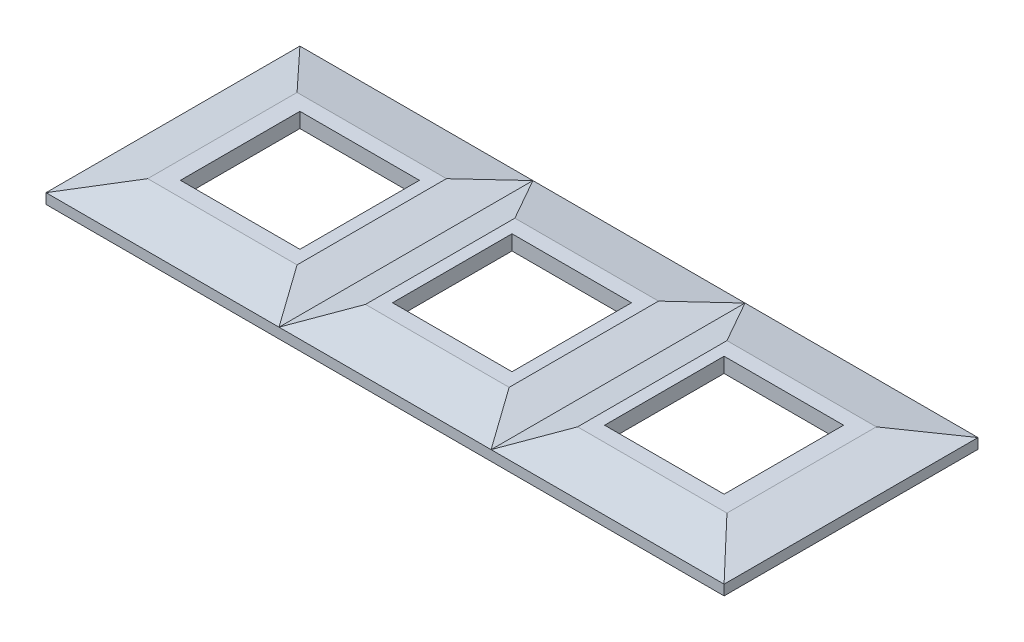
ISO-10303-21;
HEADER;
FILE_DESCRIPTION(('STEP AP214'),'2;1');
FILE_NAME('part.step','',(''),(''),'','','');
FILE_SCHEMA(('AUTOMOTIVE_DESIGN { 1 0 10303 214 1 1 1 1 }'));
ENDSEC;
DATA;
#1=APPLICATION_CONTEXT('core data for automotive mechanical design processes');
#2=APPLICATION_PROTOCOL_DEFINITION('international standard','automotive_design',2000,#1);
#3=PRODUCT_CONTEXT('',#1,'mechanical');
#4=PRODUCT('Part','Part','',(#3));
#5=PRODUCT_RELATED_PRODUCT_CATEGORY('part','',(#4));
#6=PRODUCT_DEFINITION_FORMATION('','',#4);
#7=PRODUCT_DEFINITION_CONTEXT('part definition',#1,'design');
#8=PRODUCT_DEFINITION('design','',#6,#7);
#9=PRODUCT_DEFINITION_SHAPE('','',#8);
#10=(LENGTH_UNIT() NAMED_UNIT(*) SI_UNIT(.MILLI.,.METRE.));
#11=(NAMED_UNIT(*) PLANE_ANGLE_UNIT() SI_UNIT($,.RADIAN.));
#12=(NAMED_UNIT(*) SI_UNIT($,.STERADIAN.) SOLID_ANGLE_UNIT());
#13=UNCERTAINTY_MEASURE_WITH_UNIT(LENGTH_MEASURE(1.E-05),#10,'distance_accuracy_value','');
#14=(GEOMETRIC_REPRESENTATION_CONTEXT(3) GLOBAL_UNCERTAINTY_ASSIGNED_CONTEXT((#13)) GLOBAL_UNIT_ASSIGNED_CONTEXT((#10,
#11,#12)) REPRESENTATION_CONTEXT('',''));
#15=CARTESIAN_POINT('',(0.,0.,0.));
#16=DIRECTION('',(0.,0.,1.));
#17=DIRECTION('',(1.,0.,0.));
#18=AXIS2_PLACEMENT_3D('',#15,#16,#17);
#19=CARTESIAN_POINT('',(20.,7.00000000000003,20.));
#20=DIRECTION('',(1.,0.,0.));
#21=DIRECTION('',(0.,0.,-1.));
#22=AXIS2_PLACEMENT_3D('',#19,#20,#21);
#23=PLANE('',#22);
#24=DIRECTION('',(0.,0.,-1.));
#25=VECTOR('',#24,1.);
#26=CARTESIAN_POINT('',(20.,2.,20.));
#27=LINE('',#26,#25);
#28=CARTESIAN_POINT('',(20.,2.,20.));
#29=VERTEX_POINT('',#28);
#30=CARTESIAN_POINT('',(20.,2.,-20.));
#31=VERTEX_POINT('',#30);
#32=EDGE_CURVE('E312',#29,#31,#27,.T.);
#33=ORIENTED_EDGE('',*,*,#32,.F.);
#34=DIRECTION('',(0.,-1.,0.));
#35=VECTOR('',#34,1.);
#36=CARTESIAN_POINT('',(20.,7.00000000000003,20.));
#37=LINE('',#36,#35);
#38=CARTESIAN_POINT('',(20.,7.00000000000003,20.));
#39=VERTEX_POINT('',#38);
#40=EDGE_CURVE('E406',#39,#29,#37,.T.);
#41=ORIENTED_EDGE('',*,*,#40,.F.);
#42=DIRECTION('',(0.,0.,1.));
#43=VECTOR('',#42,1.);
#44=CARTESIAN_POINT('',(20.,7.00000000000003,20.));
#45=LINE('',#44,#43);
#46=CARTESIAN_POINT('',(20.,7.00000000000003,-20.));
#47=VERTEX_POINT('',#46);
#48=EDGE_CURVE('E364',#47,#39,#45,.T.);
#49=ORIENTED_EDGE('',*,*,#48,.F.);
#50=DIRECTION('',(0.,-1.,0.));
#51=VECTOR('',#50,1.);
#52=CARTESIAN_POINT('',(20.,7.00000000000003,-20.));
#53=LINE('',#52,#51);
#54=EDGE_CURVE('E407',#47,#31,#53,.T.);
#55=ORIENTED_EDGE('',*,*,#54,.T.);
#56=EDGE_LOOP('',(#33,#41,#49,#55));
#57=FACE_BOUND('',#56,.T.);
#58=ADVANCED_FACE('F40',(#57),#23,.F.);
#59=CARTESIAN_POINT('',(-20.,7.00000000000003,-20.));
#60=DIRECTION('',(0.,0.,-1.));
#61=DIRECTION('',(-1.,0.,0.));
#62=AXIS2_PLACEMENT_3D('',#59,#60,#61);
#63=PLANE('',#62);
#64=DIRECTION('',(-1.,0.,0.));
#65=VECTOR('',#64,1.);
#66=CARTESIAN_POINT('',(-20.,2.,-20.));
#67=LINE('',#66,#65);
#68=CARTESIAN_POINT('',(-20.,2.,-20.));
#69=VERTEX_POINT('',#68);
#70=EDGE_CURVE('E310',#31,#69,#67,.T.);
#71=ORIENTED_EDGE('',*,*,#70,.F.);
#72=ORIENTED_EDGE('',*,*,#54,.F.);
#73=DIRECTION('',(1.,0.,0.));
#74=VECTOR('',#73,1.);
#75=CARTESIAN_POINT('',(-20.,7.00000000000003,-20.));
#76=LINE('',#75,#74);
#77=CARTESIAN_POINT('',(-20.,7.00000000000003,-20.));
#78=VERTEX_POINT('',#77);
#79=EDGE_CURVE('E403',#78,#47,#76,.T.);
#80=ORIENTED_EDGE('',*,*,#79,.F.);
#81=DIRECTION('',(0.,-1.,0.));
#82=VECTOR('',#81,1.);
#83=CARTESIAN_POINT('',(-20.,7.00000000000003,-20.));
#84=LINE('',#83,#82);
#85=EDGE_CURVE('E411',#78,#69,#84,.T.);
#86=ORIENTED_EDGE('',*,*,#85,.T.);
#87=EDGE_LOOP('',(#71,#72,#80,#86));
#88=FACE_BOUND('',#87,.T.);
#89=ADVANCED_FACE('F601',(#88),#63,.F.);
#90=CARTESIAN_POINT('',(-20.,7.00000000000003,20.));
#91=DIRECTION('',(-1.,0.,0.));
#92=DIRECTION('',(0.,0.,1.));
#93=AXIS2_PLACEMENT_3D('',#90,#91,#92);
#94=PLANE('',#93);
#95=DIRECTION('',(0.,0.,1.));
#96=VECTOR('',#95,1.);
#97=CARTESIAN_POINT('',(-20.,2.,20.));
#98=LINE('',#97,#96);
#99=CARTESIAN_POINT('',(-20.,2.,20.));
#100=VERTEX_POINT('',#99);
#101=EDGE_CURVE('E55',#69,#100,#98,.T.);
#102=ORIENTED_EDGE('',*,*,#101,.F.);
#103=ORIENTED_EDGE('',*,*,#85,.F.);
#104=DIRECTION('',(0.,0.,-1.));
#105=VECTOR('',#104,1.);
#106=CARTESIAN_POINT('',(-20.,7.00000000000003,20.));
#107=LINE('',#106,#105);
#108=CARTESIAN_POINT('',(-20.,7.,20.));
#109=VERTEX_POINT('',#108);
#110=EDGE_CURVE('E400',#109,#78,#107,.T.);
#111=ORIENTED_EDGE('',*,*,#110,.F.);
#112=DIRECTION('',(0.,-1.,0.));
#113=VECTOR('',#112,1.);
#114=CARTESIAN_POINT('',(-20.,7.00000000000003,20.));
#115=LINE('',#114,#113);
#116=EDGE_CURVE('E414',#109,#100,#115,.T.);
#117=ORIENTED_EDGE('',*,*,#116,.T.);
#118=EDGE_LOOP('',(#102,#103,#111,#117));
#119=FACE_BOUND('',#118,.T.);
#120=ADVANCED_FACE('F607',(#119),#94,.F.);
#121=CARTESIAN_POINT('',(-20.,7.00000000000003,20.));
#122=DIRECTION('',(0.,0.,1.));
#123=DIRECTION('',(1.,0.,0.));
#124=AXIS2_PLACEMENT_3D('',#121,#122,#123);
#125=PLANE('',#124);
#126=DIRECTION('',(1.,0.,0.));
#127=VECTOR('',#126,1.);
#128=CARTESIAN_POINT('',(-20.,2.,20.));
#129=LINE('',#128,#127);
#130=EDGE_CURVE('E307',#100,#29,#129,.T.);
#131=ORIENTED_EDGE('',*,*,#130,.F.);
#132=ORIENTED_EDGE('',*,*,#116,.F.);
#133=DIRECTION('',(-1.,0.,0.));
#134=VECTOR('',#133,1.);
#135=CARTESIAN_POINT('',(-20.,7.00000000000003,20.));
#136=LINE('',#135,#134);
#137=EDGE_CURVE('E397',#39,#109,#136,.T.);
#138=ORIENTED_EDGE('',*,*,#137,.F.);
#139=ORIENTED_EDGE('',*,*,#40,.T.);
#140=EDGE_LOOP('',(#131,#132,#138,#139));
#141=FACE_BOUND('',#140,.T.);
#142=ADVANCED_FACE('F612',(#141),#125,.F.);
#143=CARTESIAN_POINT('',(91.,7.00000000000003,20.));
#144=DIRECTION('',(1.,0.,0.));
#145=DIRECTION('',(0.,0.,-1.));
#146=AXIS2_PLACEMENT_3D('',#143,#144,#145);
#147=PLANE('',#146);
#148=DIRECTION('',(0.,0.,-1.));
#149=VECTOR('',#148,1.);
#150=CARTESIAN_POINT('',(91.,2.,20.));
#151=LINE('',#150,#149);
#152=CARTESIAN_POINT('',(91.,2.,20.));
#153=VERTEX_POINT('',#152);
#154=CARTESIAN_POINT('',(91.,2.,-20.));
#155=VERTEX_POINT('',#154);
#156=EDGE_CURVE('E305',#153,#155,#151,.T.);
#157=ORIENTED_EDGE('',*,*,#156,.F.);
#158=DIRECTION('',(0.,-1.,0.));
#159=VECTOR('',#158,1.);
#160=CARTESIAN_POINT('',(91.,7.00000000000003,20.));
#161=LINE('',#160,#159);
#162=CARTESIAN_POINT('',(91.,7.00000000000003,20.));
#163=VERTEX_POINT('',#162);
#164=EDGE_CURVE('E360',#163,#153,#161,.T.);
#165=ORIENTED_EDGE('',*,*,#164,.F.);
#166=DIRECTION('',(0.,0.,1.));
#167=VECTOR('',#166,1.);
#168=CARTESIAN_POINT('',(91.,7.00000000000003,20.));
#169=LINE('',#168,#167);
#170=CARTESIAN_POINT('',(91.,7.00000000000003,-20.));
#171=VERTEX_POINT('',#170);
#172=EDGE_CURVE('E347',#171,#163,#169,.T.);
#173=ORIENTED_EDGE('',*,*,#172,.F.);
#174=DIRECTION('',(0.,-1.,0.));
#175=VECTOR('',#174,1.);
#176=CARTESIAN_POINT('',(91.,7.00000000000003,-20.));
#177=LINE('',#176,#175);
#178=EDGE_CURVE('E361',#171,#155,#177,.T.);
#179=ORIENTED_EDGE('',*,*,#178,.T.);
#180=EDGE_LOOP('',(#157,#165,#173,#179));
#181=FACE_BOUND('',#180,.T.);
#182=ADVANCED_FACE('F835',(#181),#147,.F.);
#183=CARTESIAN_POINT('',(51.,7.00000000000003,-20.));
#184=DIRECTION('',(0.,0.,-1.));
#185=DIRECTION('',(-1.,0.,0.));
#186=AXIS2_PLACEMENT_3D('',#183,#184,#185);
#187=PLANE('',#186);
#188=DIRECTION('',(-1.,0.,0.));
#189=VECTOR('',#188,1.);
#190=CARTESIAN_POINT('',(51.,2.,-20.));
#191=LINE('',#190,#189);
#192=CARTESIAN_POINT('',(51.,2.,-20.));
#193=VERTEX_POINT('',#192);
#194=EDGE_CURVE('E303',#155,#193,#191,.T.);
#195=ORIENTED_EDGE('',*,*,#194,.F.);
#196=ORIENTED_EDGE('',*,*,#178,.F.);
#197=DIRECTION('',(1.,0.,0.));
#198=VECTOR('',#197,1.);
#199=CARTESIAN_POINT('',(51.,7.00000000000003,-20.));
#200=LINE('',#199,#198);
#201=CARTESIAN_POINT('',(51.,7.00000000000003,-20.));
#202=VERTEX_POINT('',#201);
#203=EDGE_CURVE('E357',#202,#171,#200,.T.);
#204=ORIENTED_EDGE('',*,*,#203,.F.);
#205=DIRECTION('',(0.,-1.,0.));
#206=VECTOR('',#205,1.);
#207=CARTESIAN_POINT('',(51.,7.00000000000003,-20.));
#208=LINE('',#207,#206);
#209=EDGE_CURVE('E365',#202,#193,#208,.T.);
#210=ORIENTED_EDGE('',*,*,#209,.T.);
#211=EDGE_LOOP('',(#195,#196,#204,#210));
#212=FACE_BOUND('',#211,.T.);
#213=ADVANCED_FACE('F844',(#212),#187,.F.);
#214=CARTESIAN_POINT('',(51.,7.00000000000003,20.));
#215=DIRECTION('',(-1.,0.,0.));
#216=DIRECTION('',(0.,0.,1.));
#217=AXIS2_PLACEMENT_3D('',#214,#215,#216);
#218=PLANE('',#217);
#219=DIRECTION('',(0.,0.,1.));
#220=VECTOR('',#219,1.);
#221=CARTESIAN_POINT('',(51.,2.,20.));
#222=LINE('',#221,#220);
#223=CARTESIAN_POINT('',(51.,2.,20.));
#224=VERTEX_POINT('',#223);
#225=EDGE_CURVE('E63',#193,#224,#222,.T.);
#226=ORIENTED_EDGE('',*,*,#225,.F.);
#227=ORIENTED_EDGE('',*,*,#209,.F.);
#228=DIRECTION('',(0.,0.,-1.));
#229=VECTOR('',#228,1.);
#230=CARTESIAN_POINT('',(51.,7.00000000000003,20.));
#231=LINE('',#230,#229);
#232=CARTESIAN_POINT('',(51.,7.,20.));
#233=VERTEX_POINT('',#232);
#234=EDGE_CURVE('E354',#233,#202,#231,.T.);
#235=ORIENTED_EDGE('',*,*,#234,.F.);
#236=DIRECTION('',(0.,-1.,0.));
#237=VECTOR('',#236,1.);
#238=CARTESIAN_POINT('',(51.,7.00000000000003,20.));
#239=LINE('',#238,#237);
#240=EDGE_CURVE('E368',#233,#224,#239,.T.);
#241=ORIENTED_EDGE('',*,*,#240,.T.);
#242=EDGE_LOOP('',(#226,#227,#235,#241));
#243=FACE_BOUND('',#242,.T.);
#244=ADVANCED_FACE('F854',(#243),#218,.F.);
#245=CARTESIAN_POINT('',(51.,7.00000000000003,20.));
#246=DIRECTION('',(0.,0.,1.));
#247=DIRECTION('',(1.,0.,0.));
#248=AXIS2_PLACEMENT_3D('',#245,#246,#247);
#249=PLANE('',#248);
#250=DIRECTION('',(1.,0.,0.));
#251=VECTOR('',#250,1.);
#252=CARTESIAN_POINT('',(51.,2.,20.));
#253=LINE('',#252,#251);
#254=EDGE_CURVE('E300',#224,#153,#253,.T.);
#255=ORIENTED_EDGE('',*,*,#254,.F.);
#256=ORIENTED_EDGE('',*,*,#240,.F.);
#257=DIRECTION('',(-1.,0.,0.));
#258=VECTOR('',#257,1.);
#259=CARTESIAN_POINT('',(51.,7.00000000000003,20.));
#260=LINE('',#259,#258);
#261=EDGE_CURVE('E350',#163,#233,#260,.T.);
#262=ORIENTED_EDGE('',*,*,#261,.F.);
#263=ORIENTED_EDGE('',*,*,#164,.T.);
#264=EDGE_LOOP('',(#255,#256,#262,#263));
#265=FACE_BOUND('',#264,.T.);
#266=ADVANCED_FACE('F864',(#265),#249,.F.);
#267=CARTESIAN_POINT('',(-51.,7.00000000000003,19.9999999999995));
#268=DIRECTION('',(1.,0.,0.));
#269=DIRECTION('',(0.,0.,-1.));
#270=AXIS2_PLACEMENT_3D('',#267,#268,#269);
#271=PLANE('',#270);
#272=DIRECTION('',(0.,0.,-1.));
#273=VECTOR('',#272,1.);
#274=CARTESIAN_POINT('',(-51.,2.,19.9999999999995));
#275=LINE('',#274,#273);
#276=CARTESIAN_POINT('',(-51.,2.,19.9999999999995));
#277=VERTEX_POINT('',#276);
#278=CARTESIAN_POINT('',(-51.,2.,-20.0000000000005));
#279=VERTEX_POINT('',#278);
#280=EDGE_CURVE('E298',#277,#279,#275,.T.);
#281=ORIENTED_EDGE('',*,*,#280,.F.);
#282=DIRECTION('',(0.,-1.,0.));
#283=VECTOR('',#282,1.);
#284=CARTESIAN_POINT('',(-51.,7.00000000000003,19.9999999999995));
#285=LINE('',#284,#283);
#286=CARTESIAN_POINT('',(-51.,7.00000000000003,19.9999999999995));
#287=VERTEX_POINT('',#286);
#288=EDGE_CURVE('E384',#287,#277,#285,.T.);
#289=ORIENTED_EDGE('',*,*,#288,.F.);
#290=DIRECTION('',(0.,0.,1.));
#291=VECTOR('',#290,1.);
#292=CARTESIAN_POINT('',(-51.,7.00000000000003,19.9999999999995));
#293=LINE('',#292,#291);
#294=CARTESIAN_POINT('',(-51.,7.00000000000003,-20.0000000000005));
#295=VERTEX_POINT('',#294);
#296=EDGE_CURVE('E340',#295,#287,#293,.T.);
#297=ORIENTED_EDGE('',*,*,#296,.F.);
#298=DIRECTION('',(0.,-1.,0.));
#299=VECTOR('',#298,1.);
#300=CARTESIAN_POINT('',(-51.,7.00000000000003,-20.0000000000005));
#301=LINE('',#300,#299);
#302=EDGE_CURVE('E351',#295,#279,#301,.T.);
#303=ORIENTED_EDGE('',*,*,#302,.T.);
#304=EDGE_LOOP('',(#281,#289,#297,#303));
#305=FACE_BOUND('',#304,.T.);
#306=ADVANCED_FACE('F874',(#305),#271,.F.);
#307=CARTESIAN_POINT('',(-91.,7.00000000000003,-20.0000000000005));
#308=DIRECTION('',(0.,0.,-1.));
#309=DIRECTION('',(-1.,0.,0.));
#310=AXIS2_PLACEMENT_3D('',#307,#308,#309);
#311=PLANE('',#310);
#312=DIRECTION('',(-1.,0.,0.));
#313=VECTOR('',#312,1.);
#314=CARTESIAN_POINT('',(-91.,2.,-20.0000000000005));
#315=LINE('',#314,#313);
#316=CARTESIAN_POINT('',(-91.,2.,-20.0000000000005));
#317=VERTEX_POINT('',#316);
#318=EDGE_CURVE('E296',#279,#317,#315,.T.);
#319=ORIENTED_EDGE('',*,*,#318,.F.);
#320=ORIENTED_EDGE('',*,*,#302,.F.);
#321=DIRECTION('',(1.,0.,0.));
#322=VECTOR('',#321,1.);
#323=CARTESIAN_POINT('',(-91.,7.00000000000003,-20.0000000000005));
#324=LINE('',#323,#322);
#325=CARTESIAN_POINT('',(-91.,7.00000000000003,-20.0000000000005));
#326=VERTEX_POINT('',#325);
#327=EDGE_CURVE('E381',#326,#295,#324,.T.);
#328=ORIENTED_EDGE('',*,*,#327,.F.);
#329=DIRECTION('',(0.,-1.,0.));
#330=VECTOR('',#329,1.);
#331=CARTESIAN_POINT('',(-91.,7.00000000000003,-20.0000000000005));
#332=LINE('',#331,#330);
#333=EDGE_CURVE('E387',#326,#317,#332,.T.);
#334=ORIENTED_EDGE('',*,*,#333,.T.);
#335=EDGE_LOOP('',(#319,#320,#328,#334));
#336=FACE_BOUND('',#335,.T.);
#337=ADVANCED_FACE('F884',(#336),#311,.F.);
#338=CARTESIAN_POINT('',(-91.,7.00000000000003,19.9999999999995));
#339=DIRECTION('',(-1.,0.,0.));
#340=DIRECTION('',(0.,0.,1.));
#341=AXIS2_PLACEMENT_3D('',#338,#339,#340);
#342=PLANE('',#341);
#343=DIRECTION('',(0.,0.,1.));
#344=VECTOR('',#343,1.);
#345=CARTESIAN_POINT('',(-91.,2.,19.9999999999995));
#346=LINE('',#345,#344);
#347=CARTESIAN_POINT('',(-91.,2.,19.9999999999995));
#348=VERTEX_POINT('',#347);
#349=EDGE_CURVE('E291',#317,#348,#346,.T.);
#350=ORIENTED_EDGE('',*,*,#349,.F.);
#351=ORIENTED_EDGE('',*,*,#333,.F.);
#352=DIRECTION('',(0.,0.,-1.));
#353=VECTOR('',#352,1.);
#354=CARTESIAN_POINT('',(-91.,7.00000000000003,19.9999999999995));
#355=LINE('',#354,#353);
#356=CARTESIAN_POINT('',(-91.,7.,19.9999999999995));
#357=VERTEX_POINT('',#356);
#358=EDGE_CURVE('E378',#357,#326,#355,.T.);
#359=ORIENTED_EDGE('',*,*,#358,.F.);
#360=DIRECTION('',(0.,-1.,0.));
#361=VECTOR('',#360,1.);
#362=CARTESIAN_POINT('',(-91.,7.00000000000003,19.9999999999995));
#363=LINE('',#362,#361);
#364=EDGE_CURVE('E390',#357,#348,#363,.T.);
#365=ORIENTED_EDGE('',*,*,#364,.T.);
#366=EDGE_LOOP('',(#350,#351,#359,#365));
#367=FACE_BOUND('',#366,.T.);
#368=ADVANCED_FACE('F894',(#367),#342,.F.);
#369=CARTESIAN_POINT('',(-91.,7.00000000000003,19.9999999999995));
#370=DIRECTION('',(0.,0.,1.));
#371=DIRECTION('',(1.,0.,0.));
#372=AXIS2_PLACEMENT_3D('',#369,#370,#371);
#373=PLANE('',#372);
#374=DIRECTION('',(1.,0.,0.));
#375=VECTOR('',#374,1.);
#376=CARTESIAN_POINT('',(-91.,2.,19.9999999999995));
#377=LINE('',#376,#375);
#378=EDGE_CURVE('E12',#348,#277,#377,.T.);
#379=ORIENTED_EDGE('',*,*,#378,.F.);
#380=ORIENTED_EDGE('',*,*,#364,.F.);
#381=DIRECTION('',(-1.,0.,0.));
#382=VECTOR('',#381,1.);
#383=CARTESIAN_POINT('',(-91.,7.00000000000003,19.9999999999995));
#384=LINE('',#383,#382);
#385=EDGE_CURVE('E375',#287,#357,#384,.T.);
#386=ORIENTED_EDGE('',*,*,#385,.F.);
#387=ORIENTED_EDGE('',*,*,#288,.T.);
#388=EDGE_LOOP('',(#379,#380,#386,#387));
#389=FACE_BOUND('',#388,.T.);
#390=ADVANCED_FACE('F731',(#389),#373,.F.);
#391=CARTESIAN_POINT('',(113.5,3.42098378667929,42.5));
#392=DIRECTION('',(-0.211415743298023,-0.977396226453604,0.));
#393=DIRECTION('',(0.977396226453604,-0.211415743298023,0.));
#394=AXIS2_PLACEMENT_3D('',#391,#392,#393);
#395=PLANE('',#394);
#396=DIRECTION('',(-0.679563850191699,0.146993095142223,-0.718739176261558));
#397=VECTOR('',#396,1.);
#398=CARTESIAN_POINT('',(113.5,3.42098378667929,42.5));
#399=LINE('',#398,#397);
#400=CARTESIAN_POINT('',(113.5,3.42098378667929,42.5));
#401=VERTEX_POINT('',#400);
#402=CARTESIAN_POINT('',(96.9538483901607,7.00000000000002,25.));
#403=VERTEX_POINT('',#402);
#404=EDGE_CURVE('E452',#401,#403,#399,.T.);
#405=ORIENTED_EDGE('',*,*,#404,.F.);
#406=DIRECTION('',(0.,0.,-1.));
#407=VECTOR('',#406,1.);
#408=CARTESIAN_POINT('',(113.5,3.42098378667929,42.5));
#409=LINE('',#408,#407);
#410=CARTESIAN_POINT('',(113.5,3.42098378667929,-42.5));
#411=VERTEX_POINT('',#410);
#412=EDGE_CURVE('E500',#401,#411,#409,.T.);
#413=ORIENTED_EDGE('',*,*,#412,.T.);
#414=DIRECTION('',(0.6795638501917,-0.146993095142223,-0.718739176261558));
#415=VECTOR('',#414,1.);
#416=CARTESIAN_POINT('',(71.9835212381672,12.4012079567653,1.4098102969171));
#417=LINE('',#416,#415);
#418=CARTESIAN_POINT('',(96.9538483901607,7.00000000000003,-25.));
#419=VERTEX_POINT('',#418);
#420=EDGE_CURVE('E439',#419,#411,#417,.T.);
#421=ORIENTED_EDGE('',*,*,#420,.F.);
#422=DIRECTION('',(0.,0.,-1.));
#423=VECTOR('',#422,1.);
#424=CARTESIAN_POINT('',(96.9538483901607,7.00000000000002,42.5));
#425=LINE('',#424,#423);
#426=EDGE_CURVE('E497',#403,#419,#425,.T.);
#427=ORIENTED_EDGE('',*,*,#426,.F.);
#428=EDGE_LOOP('',(#405,#413,#421,#427));
#429=FACE_BOUND('',#428,.T.);
#430=ADVANCED_FACE('F585',(#429),#395,.F.);
#431=CARTESIAN_POINT('',(96.9538483901607,7.00000000000002,42.5));
#432=DIRECTION('',(0.,-1.,0.));
#433=DIRECTION('',(1.,0.,0.));
#434=AXIS2_PLACEMENT_3D('',#431,#432,#433);
#435=PLANE('',#434);
#436=ORIENTED_EDGE('',*,*,#203,.T.);
#437=ORIENTED_EDGE('',*,*,#172,.T.);
#438=ORIENTED_EDGE('',*,*,#261,.T.);
#439=ORIENTED_EDGE('',*,*,#234,.T.);
#440=EDGE_LOOP('',(#436,#437,#438,#439));
#441=FACE_BOUND('',#440,.T.);
#442=DIRECTION('',(1.,0.,0.));
#443=VECTOR('',#442,1.);
#444=CARTESIAN_POINT('',(-123.,7.00000000000002,25.));
#445=LINE('',#444,#443);
#446=CARTESIAN_POINT('',(46.9538483901608,7.00000000000002,25.));
#447=VERTEX_POINT('',#446);
#448=EDGE_CURVE('E419',#447,#403,#445,.T.);
#449=ORIENTED_EDGE('',*,*,#448,.T.);
#450=ORIENTED_EDGE('',*,*,#426,.T.);
#451=DIRECTION('',(1.,0.,0.));
#452=VECTOR('',#451,1.);
#453=CARTESIAN_POINT('',(-123.,7.00000000000003,-25.));
#454=LINE('',#453,#452);
#455=CARTESIAN_POINT('',(46.9538483901608,7.00000000000003,-25.));
#456=VERTEX_POINT('',#455);
#457=EDGE_CURVE('E410',#456,#419,#454,.T.);
#458=ORIENTED_EDGE('',*,*,#457,.F.);
#459=DIRECTION('',(0.,0.,-1.));
#460=VECTOR('',#459,1.);
#461=CARTESIAN_POINT('',(46.9538483901607,7.,42.5));
#462=LINE('',#461,#460);
#463=EDGE_CURVE('E494',#447,#456,#462,.T.);
#464=ORIENTED_EDGE('',*,*,#463,.F.);
#465=EDGE_LOOP('',(#449,#450,#458,#464));
#466=FACE_BOUND('',#465,.T.);
#467=ADVANCED_FACE('F589',(#441,#466),#435,.F.);
#468=CARTESIAN_POINT('',(35.5,3.42098378667929,42.5));
#469=DIRECTION('',(0.298251351110059,-0.954487365846727,0.));
#470=DIRECTION('',(0.954487365846727,0.29825135111006,0.));
#471=AXIS2_PLACEMENT_3D('',#468,#469,#470);
#472=PLANE('',#471);
#473=DIRECTION('',(-0.539789670402011,-0.168669596134294,0.824728851845976));
#474=VECTOR('',#473,1.);
#475=CARTESIAN_POINT('',(35.5,3.42098378667929,42.5));
#476=LINE('',#475,#474);
#477=CARTESIAN_POINT('',(35.5,3.42098378667929,42.5));
#478=VERTEX_POINT('',#477);
#479=EDGE_CURVE('E450',#447,#478,#476,.T.);
#480=ORIENTED_EDGE('',*,*,#479,.F.);
#481=ORIENTED_EDGE('',*,*,#463,.T.);
#482=DIRECTION('',(0.539789670402012,0.168669596134294,0.824728851845976));
#483=VECTOR('',#482,1.);
#484=CARTESIAN_POINT('',(73.3403097842624,15.245051787378,15.3151027207104));
#485=LINE('',#484,#483);
#486=CARTESIAN_POINT('',(35.5,3.42098378667929,-42.5));
#487=VERTEX_POINT('',#486);
#488=EDGE_CURVE('E437',#487,#456,#485,.T.);
#489=ORIENTED_EDGE('',*,*,#488,.F.);
#490=DIRECTION('',(0.,0.,-1.));
#491=VECTOR('',#490,1.);
#492=CARTESIAN_POINT('',(35.5,3.42098378667929,42.5));
#493=LINE('',#492,#491);
#494=EDGE_CURVE('E491',#478,#487,#493,.T.);
#495=ORIENTED_EDGE('',*,*,#494,.F.);
#496=EDGE_LOOP('',(#480,#481,#489,#495));
#497=FACE_BOUND('',#496,.T.);
#498=ADVANCED_FACE('F534',(#497),#472,.F.);
#499=CARTESIAN_POINT('',(35.5,3.42098378667929,42.5));
#500=DIRECTION('',(-0.29825135111006,-0.954487365846727,0.));
#501=DIRECTION('',(0.954487365846727,-0.29825135111006,0.));
#502=AXIS2_PLACEMENT_3D('',#499,#500,#501);
#503=PLANE('',#502);
#504=DIRECTION('',(-0.53978967040201,0.168669596134294,-0.824728851845977));
#505=VECTOR('',#504,1.);
#506=CARTESIAN_POINT('',(35.5,3.42098378667929,42.5));
#507=LINE('',#506,#505);
#508=CARTESIAN_POINT('',(24.0461516098393,7.00000000000002,25.));
#509=VERTEX_POINT('',#508);
#510=EDGE_CURVE('E448',#478,#509,#507,.T.);
#511=ORIENTED_EDGE('',*,*,#510,.F.);
#512=ORIENTED_EDGE('',*,*,#494,.T.);
#513=DIRECTION('',(0.539789670402011,-0.168669596134294,-0.824728851845976));
#514=VECTOR('',#513,1.);
#515=CARTESIAN_POINT('',(-2.34030978426233,15.245051787378,15.3151027207105));
#516=LINE('',#515,#514);
#517=CARTESIAN_POINT('',(24.0461516098393,7.00000000000003,-25.));
#518=VERTEX_POINT('',#517);
#519=EDGE_CURVE('E434',#518,#487,#516,.T.);
#520=ORIENTED_EDGE('',*,*,#519,.F.);
#521=DIRECTION('',(0.,0.,-1.));
#522=VECTOR('',#521,1.);
#523=CARTESIAN_POINT('',(24.0461516098393,7.00000000000001,42.5));
#524=LINE('',#523,#522);
#525=EDGE_CURVE('E488',#509,#518,#524,.T.);
#526=ORIENTED_EDGE('',*,*,#525,.F.);
#527=EDGE_LOOP('',(#511,#512,#520,#526));
#528=FACE_BOUND('',#527,.T.);
#529=ADVANCED_FACE('F527',(#528),#503,.F.);
#530=CARTESIAN_POINT('',(-24.0461516098393,7.,42.5));
#531=DIRECTION('',(0.,-1.,0.));
#532=DIRECTION('',(1.,0.,0.));
#533=AXIS2_PLACEMENT_3D('',#530,#531,#532);
#534=PLANE('',#533);
#535=ORIENTED_EDGE('',*,*,#79,.T.);
#536=ORIENTED_EDGE('',*,*,#48,.T.);
#537=ORIENTED_EDGE('',*,*,#137,.T.);
#538=ORIENTED_EDGE('',*,*,#110,.T.);
#539=EDGE_LOOP('',(#535,#536,#537,#538));
#540=FACE_BOUND('',#539,.T.);
#541=CARTESIAN_POINT('',(-24.0461516098392,7.00000000000002,25.));
#542=VERTEX_POINT('',#541);
#543=EDGE_CURVE('E422',#542,#509,#445,.T.);
#544=ORIENTED_EDGE('',*,*,#543,.T.);
#545=ORIENTED_EDGE('',*,*,#525,.T.);
#546=CARTESIAN_POINT('',(-24.0461516098392,7.00000000000003,-25.));
#547=VERTEX_POINT('',#546);
#548=EDGE_CURVE('E426',#547,#518,#454,.T.);
#549=ORIENTED_EDGE('',*,*,#548,.F.);
#550=DIRECTION('',(0.,0.,-1.));
#551=VECTOR('',#550,1.);
#552=CARTESIAN_POINT('',(-24.0461516098393,7.,42.5));
#553=LINE('',#552,#551);
#554=EDGE_CURVE('E485',#542,#547,#553,.T.);
#555=ORIENTED_EDGE('',*,*,#554,.F.);
#556=EDGE_LOOP('',(#544,#545,#549,#555));
#557=FACE_BOUND('',#556,.T.);
#558=ADVANCED_FACE('F565',(#540,#557),#534,.F.);
#559=CARTESIAN_POINT('',(-35.5,3.42098378667929,42.5));
#560=DIRECTION('',(0.298251351110059,-0.954487365846727,0.));
#561=DIRECTION('',(0.954487365846727,0.29825135111006,0.));
#562=AXIS2_PLACEMENT_3D('',#559,#560,#561);
#563=PLANE('',#562);
#564=DIRECTION('',(-0.539789670402011,-0.168669596134294,0.824728851845976));
#565=VECTOR('',#564,1.);
#566=CARTESIAN_POINT('',(-35.5,3.42098378667929,42.5));
#567=LINE('',#566,#565);
#568=CARTESIAN_POINT('',(-35.5,3.42098378667929,42.5));
#569=VERTEX_POINT('',#568);
#570=EDGE_CURVE('E446',#542,#569,#567,.T.);
#571=ORIENTED_EDGE('',*,*,#570,.F.);
#572=ORIENTED_EDGE('',*,*,#554,.T.);
#573=DIRECTION('',(0.539789670402012,0.168669596134294,0.824728851845976));
#574=VECTOR('',#573,1.);
#575=CARTESIAN_POINT('',(2.34030978426236,15.245051787378,15.3151027207104));
#576=LINE('',#575,#574);
#577=CARTESIAN_POINT('',(-35.5,3.42098378667929,-42.5));
#578=VERTEX_POINT('',#577);
#579=EDGE_CURVE('E432',#578,#547,#576,.T.);
#580=ORIENTED_EDGE('',*,*,#579,.F.);
#581=DIRECTION('',(0.,0.,-1.));
#582=VECTOR('',#581,1.);
#583=CARTESIAN_POINT('',(-35.5,3.42098378667929,42.5));
#584=LINE('',#583,#582);
#585=EDGE_CURVE('E482',#569,#578,#584,.T.);
#586=ORIENTED_EDGE('',*,*,#585,.F.);
#587=EDGE_LOOP('',(#571,#572,#580,#586));
#588=FACE_BOUND('',#587,.T.);
#589=ADVANCED_FACE('F569',(#588),#563,.F.);
#590=CARTESIAN_POINT('',(-35.5,3.42098378667929,42.5));
#591=DIRECTION('',(-0.298251351110059,-0.954487365846727,0.));
#592=DIRECTION('',(0.954487365846727,-0.29825135111006,0.));
#593=AXIS2_PLACEMENT_3D('',#590,#591,#592);
#594=PLANE('',#593);
#595=DIRECTION('',(-0.539789670402011,0.168669596134294,-0.824728851845976));
#596=VECTOR('',#595,1.);
#597=CARTESIAN_POINT('',(-35.5,3.42098378667929,42.5));
#598=LINE('',#597,#596);
#599=CARTESIAN_POINT('',(-46.9538483901607,7.00000000000002,25.));
#600=VERTEX_POINT('',#599);
#601=EDGE_CURVE('E444',#569,#600,#598,.T.);
#602=ORIENTED_EDGE('',*,*,#601,.F.);
#603=ORIENTED_EDGE('',*,*,#585,.T.);
#604=DIRECTION('',(0.539789670402012,-0.168669596134294,-0.824728851845976));
#605=VECTOR('',#604,1.);
#606=CARTESIAN_POINT('',(-73.3403097842624,15.245051787378,15.3151027207104));
#607=LINE('',#606,#605);
#608=CARTESIAN_POINT('',(-46.9538483901607,7.00000000000003,-25.));
#609=VERTEX_POINT('',#608);
#610=EDGE_CURVE('E429',#609,#578,#607,.T.);
#611=ORIENTED_EDGE('',*,*,#610,.F.);
#612=DIRECTION('',(0.,0.,-1.));
#613=VECTOR('',#612,1.);
#614=CARTESIAN_POINT('',(-46.9538483901607,7.,42.5));
#615=LINE('',#614,#613);
#616=EDGE_CURVE('E479',#600,#609,#615,.T.);
#617=ORIENTED_EDGE('',*,*,#616,.F.);
#618=EDGE_LOOP('',(#602,#603,#611,#617));
#619=FACE_BOUND('',#618,.T.);
#620=ADVANCED_FACE('F556',(#619),#594,.F.);
#621=CARTESIAN_POINT('',(-96.9538483901607,7.,42.5));
#622=DIRECTION('',(0.,-1.,0.));
#623=DIRECTION('',(0.,0.,-1.));
#624=AXIS2_PLACEMENT_3D('',#621,#622,#623);
#625=PLANE('',#624);
#626=ORIENTED_EDGE('',*,*,#327,.T.);
#627=ORIENTED_EDGE('',*,*,#296,.T.);
#628=ORIENTED_EDGE('',*,*,#385,.T.);
#629=ORIENTED_EDGE('',*,*,#358,.T.);
#630=EDGE_LOOP('',(#626,#627,#628,#629));
#631=FACE_BOUND('',#630,.T.);
#632=CARTESIAN_POINT('',(-96.9538483901606,7.00000000000002,25.));
#633=VERTEX_POINT('',#632);
#634=EDGE_CURVE('E424',#633,#600,#445,.T.);
#635=ORIENTED_EDGE('',*,*,#634,.T.);
#636=ORIENTED_EDGE('',*,*,#616,.T.);
#637=CARTESIAN_POINT('',(-96.9538483901606,7.00000000000003,-25.));
#638=VERTEX_POINT('',#637);
#639=EDGE_CURVE('E423',#638,#609,#454,.T.);
#640=ORIENTED_EDGE('',*,*,#639,.F.);
#641=DIRECTION('',(0.,0.,-1.));
#642=VECTOR('',#641,1.);
#643=CARTESIAN_POINT('',(-96.9538483901607,7.,42.5));
#644=LINE('',#643,#642);
#645=EDGE_CURVE('E476',#633,#638,#644,.T.);
#646=ORIENTED_EDGE('',*,*,#645,.F.);
#647=EDGE_LOOP('',(#635,#636,#640,#646));
#648=FACE_BOUND('',#647,.T.);
#649=ADVANCED_FACE('F559',(#631,#648),#625,.F.);
#650=CARTESIAN_POINT('',(-113.5,3.42098378667929,42.5));
#651=DIRECTION('',(0.211415743298022,-0.977396226453604,0.));
#652=DIRECTION('',(0.977396226453604,0.211415743298022,0.));
#653=AXIS2_PLACEMENT_3D('',#650,#651,#652);
#654=PLANE('',#653);
#655=DIRECTION('',(-0.679563850191701,-0.146993095142223,0.718739176261556));
#656=VECTOR('',#655,1.);
#657=CARTESIAN_POINT('',(-113.5,3.42098378667929,42.5));
#658=LINE('',#657,#656);
#659=CARTESIAN_POINT('',(-113.5,3.42098378667929,42.5));
#660=VERTEX_POINT('',#659);
#661=EDGE_CURVE('E442',#633,#660,#658,.T.);
#662=ORIENTED_EDGE('',*,*,#661,.F.);
#663=ORIENTED_EDGE('',*,*,#645,.T.);
#664=DIRECTION('',(0.679563850191702,0.146993095142223,0.718739176261555));
#665=VECTOR('',#664,1.);
#666=CARTESIAN_POINT('',(-71.9835212381672,12.4012079567652,1.40981029691683));
#667=LINE('',#666,#665);
#668=CARTESIAN_POINT('',(-113.5,3.42098378667929,-42.5));
#669=VERTEX_POINT('',#668);
#670=EDGE_CURVE('E427',#669,#638,#667,.T.);
#671=ORIENTED_EDGE('',*,*,#670,.F.);
#672=DIRECTION('',(0.,0.,-1.));
#673=VECTOR('',#672,1.);
#674=CARTESIAN_POINT('',(-113.5,3.42098378667929,42.5));
#675=LINE('',#674,#673);
#676=EDGE_CURVE('E473',#660,#669,#675,.T.);
#677=ORIENTED_EDGE('',*,*,#676,.F.);
#678=EDGE_LOOP('',(#662,#663,#671,#677));
#679=FACE_BOUND('',#678,.T.);
#680=ADVANCED_FACE('F572',(#679),#654,.F.);
#681=CARTESIAN_POINT('',(0.,0.,42.5));
#682=DIRECTION('',(0.,0.,1.));
#683=DIRECTION('',(1.,0.,0.));
#684=AXIS2_PLACEMENT_3D('',#681,#682,#683);
#685=PLANE('',#684);
#686=DIRECTION('',(0.,1.,0.));
#687=VECTOR('',#686,1.);
#688=CARTESIAN_POINT('',(113.5,0.,42.5));
#689=LINE('',#688,#687);
#690=CARTESIAN_POINT('',(113.5,0.,42.5));
#691=VERTEX_POINT('',#690);
#692=EDGE_CURVE('E458',#691,#401,#689,.T.);
#693=ORIENTED_EDGE('',*,*,#692,.T.);
#694=DIRECTION('',(-1.,0.,0.));
#695=VECTOR('',#694,1.);
#696=CARTESIAN_POINT('',(0.,3.42098378667929,42.5));
#697=LINE('',#696,#695);
#698=EDGE_CURVE('E48',#401,#478,#697,.T.);
#699=ORIENTED_EDGE('',*,*,#698,.T.);
#700=EDGE_CURVE('E511',#478,#569,#697,.T.);
#701=ORIENTED_EDGE('',*,*,#700,.T.);
#702=EDGE_CURVE('E509',#569,#660,#697,.T.);
#703=ORIENTED_EDGE('',*,*,#702,.T.);
#704=DIRECTION('',(0.,-1.,0.));
#705=VECTOR('',#704,1.);
#706=CARTESIAN_POINT('',(-113.5,0.,42.5));
#707=LINE('',#706,#705);
#708=CARTESIAN_POINT('',(-113.5,0.,42.5));
#709=VERTEX_POINT('',#708);
#710=EDGE_CURVE('E462',#660,#709,#707,.T.);
#711=ORIENTED_EDGE('',*,*,#710,.T.);
#712=DIRECTION('',(1.,0.,0.));
#713=VECTOR('',#712,1.);
#714=CARTESIAN_POINT('',(-113.5,0.,42.5));
#715=LINE('',#714,#713);
#716=EDGE_CURVE('E455',#709,#691,#715,.T.);
#717=ORIENTED_EDGE('',*,*,#716,.T.);
#718=EDGE_LOOP('',(#693,#699,#701,#703,#711,#717));
#719=FACE_BOUND('',#718,.T.);
#720=ADVANCED_FACE('F518',(#719),#685,.T.);
#721=CARTESIAN_POINT('',(0.,0.,-42.5));
#722=DIRECTION('',(0.,0.,1.));
#723=DIRECTION('',(1.,0.,0.));
#724=AXIS2_PLACEMENT_3D('',#721,#722,#723);
#725=PLANE('',#724);
#726=DIRECTION('',(-1.,0.,0.));
#727=VECTOR('',#726,1.);
#728=CARTESIAN_POINT('',(0.,3.42098378667929,-42.5));
#729=LINE('',#728,#727);
#730=EDGE_CURVE('E508',#411,#487,#729,.T.);
#731=ORIENTED_EDGE('',*,*,#730,.F.);
#732=DIRECTION('',(0.,1.,0.));
#733=VECTOR('',#732,1.);
#734=CARTESIAN_POINT('',(113.5,0.,-42.5));
#735=LINE('',#734,#733);
#736=CARTESIAN_POINT('',(113.5,0.,-42.5));
#737=VERTEX_POINT('',#736);
#738=EDGE_CURVE('E467',#737,#411,#735,.T.);
#739=ORIENTED_EDGE('',*,*,#738,.F.);
#740=DIRECTION('',(1.,0.,0.));
#741=VECTOR('',#740,1.);
#742=CARTESIAN_POINT('',(-113.5,0.,-42.5));
#743=LINE('',#742,#741);
#744=CARTESIAN_POINT('',(-113.5,0.,-42.5));
#745=VERTEX_POINT('',#744);
#746=EDGE_CURVE('E454',#745,#737,#743,.T.);
#747=ORIENTED_EDGE('',*,*,#746,.F.);
#748=DIRECTION('',(0.,-1.,0.));
#749=VECTOR('',#748,1.);
#750=CARTESIAN_POINT('',(-113.5,0.,-42.5));
#751=LINE('',#750,#749);
#752=EDGE_CURVE('E459',#669,#745,#751,.T.);
#753=ORIENTED_EDGE('',*,*,#752,.F.);
#754=EDGE_CURVE('E506',#578,#669,#729,.T.);
#755=ORIENTED_EDGE('',*,*,#754,.F.);
#756=EDGE_CURVE('E507',#487,#578,#729,.T.);
#757=ORIENTED_EDGE('',*,*,#756,.F.);
#758=EDGE_LOOP('',(#731,#739,#747,#753,#755,#757));
#759=FACE_BOUND('',#758,.T.);
#760=ADVANCED_FACE('F542',(#759),#725,.F.);
#761=CARTESIAN_POINT('',(-113.5,0.,42.5));
#762=DIRECTION('',(0.,1.,0.));
#763=DIRECTION('',(0.,0.,1.));
#764=AXIS2_PLACEMENT_3D('',#761,#762,#763);
#765=PLANE('',#764);
#766=DIRECTION('',(-1.,0.,0.));
#767=VECTOR('',#766,1.);
#768=CARTESIAN_POINT('',(-111.5,0.,41.));
#769=LINE('',#768,#767);
#770=CARTESIAN_POINT('',(111.5,0.,41.));
#771=VERTEX_POINT('',#770);
#772=CARTESIAN_POINT('',(-111.5,0.,41.));
#773=VERTEX_POINT('',#772);
#774=EDGE_CURVE('E330',#771,#773,#769,.T.);
#775=ORIENTED_EDGE('',*,*,#774,.F.);
#776=DIRECTION('',(0.,0.,1.));
#777=VECTOR('',#776,1.);
#778=CARTESIAN_POINT('',(111.5,0.,41.));
#779=LINE('',#778,#777);
#780=CARTESIAN_POINT('',(111.5,0.,-41.));
#781=VERTEX_POINT('',#780);
#782=EDGE_CURVE('E314',#781,#771,#779,.T.);
#783=ORIENTED_EDGE('',*,*,#782,.F.);
#784=DIRECTION('',(1.,0.,0.));
#785=VECTOR('',#784,1.);
#786=CARTESIAN_POINT('',(-111.5,0.,-41.));
#787=LINE('',#786,#785);
#788=CARTESIAN_POINT('',(-111.5,0.,-41.));
#789=VERTEX_POINT('',#788);
#790=EDGE_CURVE('E319',#789,#781,#787,.T.);
#791=ORIENTED_EDGE('',*,*,#790,.F.);
#792=DIRECTION('',(0.,0.,-1.));
#793=VECTOR('',#792,1.);
#794=CARTESIAN_POINT('',(-111.5,0.,41.));
#795=LINE('',#794,#793);
#796=EDGE_CURVE('E333',#773,#789,#795,.T.);
#797=ORIENTED_EDGE('',*,*,#796,.F.);
#798=EDGE_LOOP('',(#775,#783,#791,#797));
#799=FACE_BOUND('',#798,.T.);
#800=ORIENTED_EDGE('',*,*,#746,.T.);
#801=DIRECTION('',(0.,0.,-1.));
#802=VECTOR('',#801,1.);
#803=CARTESIAN_POINT('',(113.5,0.,42.5));
#804=LINE('',#803,#802);
#805=EDGE_CURVE('E503',#691,#737,#804,.T.);
#806=ORIENTED_EDGE('',*,*,#805,.F.);
#807=ORIENTED_EDGE('',*,*,#716,.F.);
#808=DIRECTION('',(0.,0.,-1.));
#809=VECTOR('',#808,1.);
#810=CARTESIAN_POINT('',(-113.5,0.,42.5));
#811=LINE('',#810,#809);
#812=EDGE_CURVE('E464',#709,#745,#811,.T.);
#813=ORIENTED_EDGE('',*,*,#812,.T.);
#814=EDGE_LOOP('',(#800,#806,#807,#813));
#815=FACE_BOUND('',#814,.T.);
#816=ADVANCED_FACE('F42',(#799,#815),#765,.F.);
#817=CARTESIAN_POINT('',(113.5,0.,42.5));
#818=DIRECTION('',(-1.,0.,0.));
#819=DIRECTION('',(0.,0.,1.));
#820=AXIS2_PLACEMENT_3D('',#817,#818,#819);
#821=PLANE('',#820);
#822=ORIENTED_EDGE('',*,*,#738,.T.);
#823=ORIENTED_EDGE('',*,*,#412,.F.);
#824=ORIENTED_EDGE('',*,*,#692,.F.);
#825=ORIENTED_EDGE('',*,*,#805,.T.);
#826=EDGE_LOOP('',(#822,#823,#824,#825));
#827=FACE_BOUND('',#826,.T.);
#828=ADVANCED_FACE('F582',(#827),#821,.F.);
#829=CARTESIAN_POINT('',(-113.5,0.,42.5));
#830=DIRECTION('',(1.,0.,0.));
#831=DIRECTION('',(0.,0.,-1.));
#832=AXIS2_PLACEMENT_3D('',#829,#830,#831);
#833=PLANE('',#832);
#834=ORIENTED_EDGE('',*,*,#752,.T.);
#835=ORIENTED_EDGE('',*,*,#812,.F.);
#836=ORIENTED_EDGE('',*,*,#710,.F.);
#837=ORIENTED_EDGE('',*,*,#676,.T.);
#838=EDGE_LOOP('',(#834,#835,#836,#837));
#839=FACE_BOUND('',#838,.T.);
#840=ADVANCED_FACE('F576',(#839),#833,.F.);
#841=CARTESIAN_POINT('',(-123.,3.42098378667929,-42.5));
#842=DIRECTION('',(0.,0.979720748978919,-0.200367796864131));
#843=DIRECTION('',(0.,0.200367796864131,0.979720748978919));
#844=AXIS2_PLACEMENT_3D('',#841,#842,#843);
#845=PLANE('',#844);
#846=ORIENTED_EDGE('',*,*,#610,.T.);
#847=ORIENTED_EDGE('',*,*,#754,.T.);
#848=ORIENTED_EDGE('',*,*,#670,.T.);
#849=ORIENTED_EDGE('',*,*,#639,.T.);
#850=EDGE_LOOP('',(#846,#847,#848,#849));
#851=FACE_BOUND('',#850,.T.);
#852=ADVANCED_FACE('F550',(#851),#845,.T.);
#853=ORIENTED_EDGE('',*,*,#519,.T.);
#854=ORIENTED_EDGE('',*,*,#756,.T.);
#855=ORIENTED_EDGE('',*,*,#579,.T.);
#856=ORIENTED_EDGE('',*,*,#548,.T.);
#857=EDGE_LOOP('',(#853,#854,#855,#856));
#858=FACE_BOUND('',#857,.T.);
#859=ADVANCED_FACE('F545',(#858),#845,.T.);
#860=ORIENTED_EDGE('',*,*,#420,.T.);
#861=ORIENTED_EDGE('',*,*,#730,.T.);
#862=ORIENTED_EDGE('',*,*,#488,.T.);
#863=ORIENTED_EDGE('',*,*,#457,.T.);
#864=EDGE_LOOP('',(#860,#861,#862,#863));
#865=FACE_BOUND('',#864,.T.);
#866=ADVANCED_FACE('F590',(#865),#845,.T.);
#867=CARTESIAN_POINT('',(-123.,3.42098378667929,42.5));
#868=DIRECTION('',(0.,0.979720748978919,0.200367796864131));
#869=DIRECTION('',(0.,-0.200367796864131,0.979720748978919));
#870=AXIS2_PLACEMENT_3D('',#867,#868,#869);
#871=PLANE('',#870);
#872=ORIENTED_EDGE('',*,*,#601,.T.);
#873=ORIENTED_EDGE('',*,*,#634,.F.);
#874=ORIENTED_EDGE('',*,*,#661,.T.);
#875=ORIENTED_EDGE('',*,*,#702,.F.);
#876=EDGE_LOOP('',(#872,#873,#874,#875));
#877=FACE_BOUND('',#876,.T.);
#878=ADVANCED_FACE('F570',(#877),#871,.T.);
#879=ORIENTED_EDGE('',*,*,#510,.T.);
#880=ORIENTED_EDGE('',*,*,#543,.F.);
#881=ORIENTED_EDGE('',*,*,#570,.T.);
#882=ORIENTED_EDGE('',*,*,#700,.F.);
#883=EDGE_LOOP('',(#879,#880,#881,#882));
#884=FACE_BOUND('',#883,.T.);
#885=ADVANCED_FACE('F567',(#884),#871,.T.);
#886=ORIENTED_EDGE('',*,*,#404,.T.);
#887=ORIENTED_EDGE('',*,*,#448,.F.);
#888=ORIENTED_EDGE('',*,*,#479,.T.);
#889=ORIENTED_EDGE('',*,*,#698,.F.);
#890=EDGE_LOOP('',(#886,#887,#888,#889));
#891=FACE_BOUND('',#890,.T.);
#892=ADVANCED_FACE('F587',(#891),#871,.T.);
#893=CARTESIAN_POINT('',(0.,1.,0.));
#894=DIRECTION('',(0.,-1.,0.));
#895=DIRECTION('',(0.,0.,-1.));
#896=AXIS2_PLACEMENT_3D('',#893,#894,#895);
#897=PLANE('',#896);
#898=DIRECTION('',(0.,0.,1.));
#899=VECTOR('',#898,1.);
#900=CARTESIAN_POINT('',(106.5,1.,35.5));
#901=LINE('',#900,#899);
#902=CARTESIAN_POINT('',(106.5,1.,-35.5));
#903=VERTEX_POINT('',#902);
#904=CARTESIAN_POINT('',(106.5,1.,35.5));
#905=VERTEX_POINT('',#904);
#906=EDGE_CURVE('E258',#903,#905,#901,.T.);
#907=ORIENTED_EDGE('',*,*,#906,.F.);
#908=DIRECTION('',(1.,0.,0.));
#909=VECTOR('',#908,1.);
#910=CARTESIAN_POINT('',(-106.5,1.,-35.5));
#911=LINE('',#910,#909);
#912=CARTESIAN_POINT('',(-106.5,1.,-35.5));
#913=VERTEX_POINT('',#912);
#914=EDGE_CURVE('E276',#913,#903,#911,.T.);
#915=ORIENTED_EDGE('',*,*,#914,.F.);
#916=DIRECTION('',(0.,0.,-1.));
#917=VECTOR('',#916,1.);
#918=CARTESIAN_POINT('',(-106.5,1.,35.5));
#919=LINE('',#918,#917);
#920=CARTESIAN_POINT('',(-106.5,1.,35.5));
#921=VERTEX_POINT('',#920);
#922=EDGE_CURVE('E279',#921,#913,#919,.T.);
#923=ORIENTED_EDGE('',*,*,#922,.F.);
#924=DIRECTION('',(-1.,0.,0.));
#925=VECTOR('',#924,1.);
#926=CARTESIAN_POINT('',(-106.5,1.,35.5));
#927=LINE('',#926,#925);
#928=EDGE_CURVE('E285',#905,#921,#927,.T.);
#929=ORIENTED_EDGE('',*,*,#928,.F.);
#930=EDGE_LOOP('',(#907,#915,#923,#929));
#931=FACE_BOUND('',#930,.T.);
#932=DIRECTION('',(0.,0.,1.));
#933=VECTOR('',#932,1.);
#934=CARTESIAN_POINT('',(111.5,1.,41.));
#935=LINE('',#934,#933);
#936=CARTESIAN_POINT('',(111.5,1.,-41.));
#937=VERTEX_POINT('',#936);
#938=CARTESIAN_POINT('',(111.5,1.,41.));
#939=VERTEX_POINT('',#938);
#940=EDGE_CURVE('E315',#937,#939,#935,.T.);
#941=ORIENTED_EDGE('',*,*,#940,.T.);
#942=DIRECTION('',(-1.,0.,0.));
#943=VECTOR('',#942,1.);
#944=CARTESIAN_POINT('',(-111.5,1.,41.));
#945=LINE('',#944,#943);
#946=CARTESIAN_POINT('',(-111.5,1.,41.));
#947=VERTEX_POINT('',#946);
#948=EDGE_CURVE('E318',#939,#947,#945,.T.);
#949=ORIENTED_EDGE('',*,*,#948,.T.);
#950=DIRECTION('',(0.,0.,-1.));
#951=VECTOR('',#950,1.);
#952=CARTESIAN_POINT('',(-111.5,1.,41.));
#953=LINE('',#952,#951);
#954=CARTESIAN_POINT('',(-111.5,1.,-41.));
#955=VERTEX_POINT('',#954);
#956=EDGE_CURVE('E322',#947,#955,#953,.T.);
#957=ORIENTED_EDGE('',*,*,#956,.T.);
#958=DIRECTION('',(1.,0.,0.));
#959=VECTOR('',#958,1.);
#960=CARTESIAN_POINT('',(-111.5,1.,-41.));
#961=LINE('',#960,#959);
#962=EDGE_CURVE('E325',#955,#937,#961,.T.);
#963=ORIENTED_EDGE('',*,*,#962,.T.);
#964=EDGE_LOOP('',(#941,#949,#957,#963));
#965=FACE_BOUND('',#964,.T.);
#966=ADVANCED_FACE('F615',(#931,#965),#897,.T.);
#967=CARTESIAN_POINT('',(111.5,1.,41.));
#968=DIRECTION('',(1.,0.,0.));
#969=DIRECTION('',(0.,0.,-1.));
#970=AXIS2_PLACEMENT_3D('',#967,#968,#969);
#971=PLANE('',#970);
#972=ORIENTED_EDGE('',*,*,#782,.T.);
#973=DIRECTION('',(0.,-1.,0.));
#974=VECTOR('',#973,1.);
#975=CARTESIAN_POINT('',(111.5,1.,41.));
#976=LINE('',#975,#974);
#977=EDGE_CURVE('E328',#939,#771,#976,.T.);
#978=ORIENTED_EDGE('',*,*,#977,.F.);
#979=ORIENTED_EDGE('',*,*,#940,.F.);
#980=DIRECTION('',(0.,-1.,0.));
#981=VECTOR('',#980,1.);
#982=CARTESIAN_POINT('',(111.5,1.,-41.));
#983=LINE('',#982,#981);
#984=EDGE_CURVE('E338',#937,#781,#983,.T.);
#985=ORIENTED_EDGE('',*,*,#984,.T.);
#986=EDGE_LOOP('',(#972,#978,#979,#985));
#987=FACE_BOUND('',#986,.T.);
#988=ADVANCED_FACE('F620',(#987),#971,.F.);
#989=CARTESIAN_POINT('',(-111.5,1.,-41.));
#990=DIRECTION('',(0.,0.,-1.));
#991=DIRECTION('',(-1.,0.,0.));
#992=AXIS2_PLACEMENT_3D('',#989,#990,#991);
#993=PLANE('',#992);
#994=ORIENTED_EDGE('',*,*,#790,.T.);
#995=ORIENTED_EDGE('',*,*,#984,.F.);
#996=ORIENTED_EDGE('',*,*,#962,.F.);
#997=DIRECTION('',(0.,-1.,0.));
#998=VECTOR('',#997,1.);
#999=CARTESIAN_POINT('',(-111.5,1.,-41.));
#1000=LINE('',#999,#998);
#1001=EDGE_CURVE('E341',#955,#789,#1000,.T.);
#1002=ORIENTED_EDGE('',*,*,#1001,.T.);
#1003=EDGE_LOOP('',(#994,#995,#996,#1002));
#1004=FACE_BOUND('',#1003,.T.);
#1005=ADVANCED_FACE('F774',(#1004),#993,.F.);
#1006=CARTESIAN_POINT('',(-111.5,1.,41.));
#1007=DIRECTION('',(-1.,0.,0.));
#1008=DIRECTION('',(0.,0.,1.));
#1009=AXIS2_PLACEMENT_3D('',#1006,#1007,#1008);
#1010=PLANE('',#1009);
#1011=ORIENTED_EDGE('',*,*,#796,.T.);
#1012=ORIENTED_EDGE('',*,*,#1001,.F.);
#1013=ORIENTED_EDGE('',*,*,#956,.F.);
#1014=DIRECTION('',(0.,-1.,0.));
#1015=VECTOR('',#1014,1.);
#1016=CARTESIAN_POINT('',(-111.5,1.,41.));
#1017=LINE('',#1016,#1015);
#1018=EDGE_CURVE('E343',#947,#773,#1017,.T.);
#1019=ORIENTED_EDGE('',*,*,#1018,.T.);
#1020=EDGE_LOOP('',(#1011,#1012,#1013,#1019));
#1021=FACE_BOUND('',#1020,.T.);
#1022=ADVANCED_FACE('F785',(#1021),#1010,.F.);
#1023=CARTESIAN_POINT('',(-111.5,1.,41.));
#1024=DIRECTION('',(0.,0.,1.));
#1025=DIRECTION('',(1.,0.,0.));
#1026=AXIS2_PLACEMENT_3D('',#1023,#1024,#1025);
#1027=PLANE('',#1026);
#1028=ORIENTED_EDGE('',*,*,#774,.T.);
#1029=ORIENTED_EDGE('',*,*,#1018,.F.);
#1030=ORIENTED_EDGE('',*,*,#948,.F.);
#1031=ORIENTED_EDGE('',*,*,#977,.T.);
#1032=EDGE_LOOP('',(#1028,#1029,#1030,#1031));
#1033=FACE_BOUND('',#1032,.T.);
#1034=ADVANCED_FACE('F795',(#1033),#1027,.F.);
#1035=CARTESIAN_POINT('',(0.,2.,0.));
#1036=DIRECTION('',(0.,-1.,0.));
#1037=DIRECTION('',(0.,0.,-1.));
#1038=AXIS2_PLACEMENT_3D('',#1035,#1036,#1037);
#1039=PLANE('',#1038);
#1040=ORIENTED_EDGE('',*,*,#156,.T.);
#1041=ORIENTED_EDGE('',*,*,#194,.T.);
#1042=ORIENTED_EDGE('',*,*,#225,.T.);
#1043=ORIENTED_EDGE('',*,*,#254,.T.);
#1044=EDGE_LOOP('',(#1040,#1041,#1042,#1043));
#1045=FACE_BOUND('',#1044,.T.);
#1046=DIRECTION('',(0.,0.,1.));
#1047=VECTOR('',#1046,1.);
#1048=CARTESIAN_POINT('',(106.5,2.,35.5));
#1049=LINE('',#1048,#1047);
#1050=CARTESIAN_POINT('',(106.5,2.,-35.5));
#1051=VERTEX_POINT('',#1050);
#1052=CARTESIAN_POINT('',(106.5,2.,35.5));
#1053=VERTEX_POINT('',#1052);
#1054=EDGE_CURVE('E255',#1051,#1053,#1049,.T.);
#1055=ORIENTED_EDGE('',*,*,#1054,.T.);
#1056=DIRECTION('',(-1.,0.,0.));
#1057=VECTOR('',#1056,1.);
#1058=CARTESIAN_POINT('',(-106.5,2.,35.5));
#1059=LINE('',#1058,#1057);
#1060=CARTESIAN_POINT('',(-106.5,2.,35.5));
#1061=VERTEX_POINT('',#1060);
#1062=EDGE_CURVE('E266',#1053,#1061,#1059,.T.);
#1063=ORIENTED_EDGE('',*,*,#1062,.T.);
#1064=DIRECTION('',(0.,0.,-1.));
#1065=VECTOR('',#1064,1.);
#1066=CARTESIAN_POINT('',(-106.5,2.,35.5));
#1067=LINE('',#1066,#1065);
#1068=CARTESIAN_POINT('',(-106.5,2.,-35.5));
#1069=VERTEX_POINT('',#1068);
#1070=EDGE_CURVE('E271',#1061,#1069,#1067,.T.);
#1071=ORIENTED_EDGE('',*,*,#1070,.T.);
#1072=DIRECTION('',(1.,0.,0.));
#1073=VECTOR('',#1072,1.);
#1074=CARTESIAN_POINT('',(-106.5,2.,-35.5));
#1075=LINE('',#1074,#1073);
#1076=EDGE_CURVE('E263',#1069,#1051,#1075,.T.);
#1077=ORIENTED_EDGE('',*,*,#1076,.T.);
#1078=EDGE_LOOP('',(#1055,#1063,#1071,#1077));
#1079=FACE_BOUND('',#1078,.T.);
#1080=ORIENTED_EDGE('',*,*,#280,.T.);
#1081=ORIENTED_EDGE('',*,*,#318,.T.);
#1082=ORIENTED_EDGE('',*,*,#349,.T.);
#1083=ORIENTED_EDGE('',*,*,#378,.T.);
#1084=EDGE_LOOP('',(#1080,#1081,#1082,#1083));
#1085=FACE_BOUND('',#1084,.T.);
#1086=ORIENTED_EDGE('',*,*,#32,.T.);
#1087=ORIENTED_EDGE('',*,*,#70,.T.);
#1088=ORIENTED_EDGE('',*,*,#101,.T.);
#1089=ORIENTED_EDGE('',*,*,#130,.T.);
#1090=EDGE_LOOP('',(#1086,#1087,#1088,#1089));
#1091=FACE_BOUND('',#1090,.T.);
#1092=ADVANCED_FACE('F273',(#1045,#1079,#1085,#1091),#1039,.T.);
#1093=CARTESIAN_POINT('',(106.5,2.,35.5));
#1094=DIRECTION('',(1.,0.,0.));
#1095=DIRECTION('',(0.,0.,-1.));
#1096=AXIS2_PLACEMENT_3D('',#1093,#1094,#1095);
#1097=PLANE('',#1096);
#1098=ORIENTED_EDGE('',*,*,#906,.T.);
#1099=DIRECTION('',(0.,-1.,0.));
#1100=VECTOR('',#1099,1.);
#1101=CARTESIAN_POINT('',(106.5,2.,35.5));
#1102=LINE('',#1101,#1100);
#1103=EDGE_CURVE('E251',#1053,#905,#1102,.T.);
#1104=ORIENTED_EDGE('',*,*,#1103,.F.);
#1105=ORIENTED_EDGE('',*,*,#1054,.F.);
#1106=DIRECTION('',(0.,-1.,0.));
#1107=VECTOR('',#1106,1.);
#1108=CARTESIAN_POINT('',(106.5,2.,-35.5));
#1109=LINE('',#1108,#1107);
#1110=EDGE_CURVE('E289',#1051,#903,#1109,.T.);
#1111=ORIENTED_EDGE('',*,*,#1110,.T.);
#1112=EDGE_LOOP('',(#1098,#1104,#1105,#1111));
#1113=FACE_BOUND('',#1112,.T.);
#1114=ADVANCED_FACE('F253',(#1113),#1097,.F.);
#1115=CARTESIAN_POINT('',(-106.5,2.,-35.5));
#1116=DIRECTION('',(0.,0.,-1.));
#1117=DIRECTION('',(-1.,0.,0.));
#1118=AXIS2_PLACEMENT_3D('',#1115,#1116,#1117);
#1119=PLANE('',#1118);
#1120=ORIENTED_EDGE('',*,*,#914,.T.);
#1121=ORIENTED_EDGE('',*,*,#1110,.F.);
#1122=ORIENTED_EDGE('',*,*,#1076,.F.);
#1123=DIRECTION('',(0.,-1.,0.));
#1124=VECTOR('',#1123,1.);
#1125=CARTESIAN_POINT('',(-106.5,2.,-35.5));
#1126=LINE('',#1125,#1124);
#1127=EDGE_CURVE('E292',#1069,#913,#1126,.T.);
#1128=ORIENTED_EDGE('',*,*,#1127,.T.);
#1129=EDGE_LOOP('',(#1120,#1121,#1122,#1128));
#1130=FACE_BOUND('',#1129,.T.);
#1131=ADVANCED_FACE('F928',(#1130),#1119,.F.);
#1132=CARTESIAN_POINT('',(-106.5,2.,35.5));
#1133=DIRECTION('',(-1.,0.,0.));
#1134=DIRECTION('',(0.,0.,1.));
#1135=AXIS2_PLACEMENT_3D('',#1132,#1133,#1134);
#1136=PLANE('',#1135);
#1137=ORIENTED_EDGE('',*,*,#922,.T.);
#1138=ORIENTED_EDGE('',*,*,#1127,.F.);
#1139=ORIENTED_EDGE('',*,*,#1070,.F.);
#1140=DIRECTION('',(0.,-1.,0.));
#1141=VECTOR('',#1140,1.);
#1142=CARTESIAN_POINT('',(-106.5,2.,35.5));
#1143=LINE('',#1142,#1141);
#1144=EDGE_CURVE('E262',#1061,#921,#1143,.T.);
#1145=ORIENTED_EDGE('',*,*,#1144,.T.);
#1146=EDGE_LOOP('',(#1137,#1138,#1139,#1145));
#1147=FACE_BOUND('',#1146,.T.);
#1148=ADVANCED_FACE('F937',(#1147),#1136,.F.);
#1149=CARTESIAN_POINT('',(-106.5,2.,35.5));
#1150=DIRECTION('',(0.,0.,1.));
#1151=DIRECTION('',(1.,0.,0.));
#1152=AXIS2_PLACEMENT_3D('',#1149,#1150,#1151);
#1153=PLANE('',#1152);
#1154=ORIENTED_EDGE('',*,*,#928,.T.);
#1155=ORIENTED_EDGE('',*,*,#1144,.F.);
#1156=ORIENTED_EDGE('',*,*,#1062,.F.);
#1157=ORIENTED_EDGE('',*,*,#1103,.T.);
#1158=EDGE_LOOP('',(#1154,#1155,#1156,#1157));
#1159=FACE_BOUND('',#1158,.T.);
#1160=ADVANCED_FACE('F267',(#1159),#1153,.F.);
#1161=CLOSED_SHELL('',(#58,#89,#120,#142,#182,#213,#244,#266,#306,#337,#368,#390,#430,#467,#498,
#529,#558,#589,#620,#649,#680,#720,#760,#816,#828,#840,#852,#859,#866,#878,#885,#892,#966,#988,
#1005,#1022,#1034,#1092,#1114,#1131,#1148,#1160));
#1162=MANIFOLD_SOLID_BREP('B2',#1161);
#1163=ADVANCED_BREP_SHAPE_REPRESENTATION('',(#18,#1162),#14);
#1164=SHAPE_DEFINITION_REPRESENTATION(#9,#1163);
ENDSEC;
END-ISO-10303-21;
